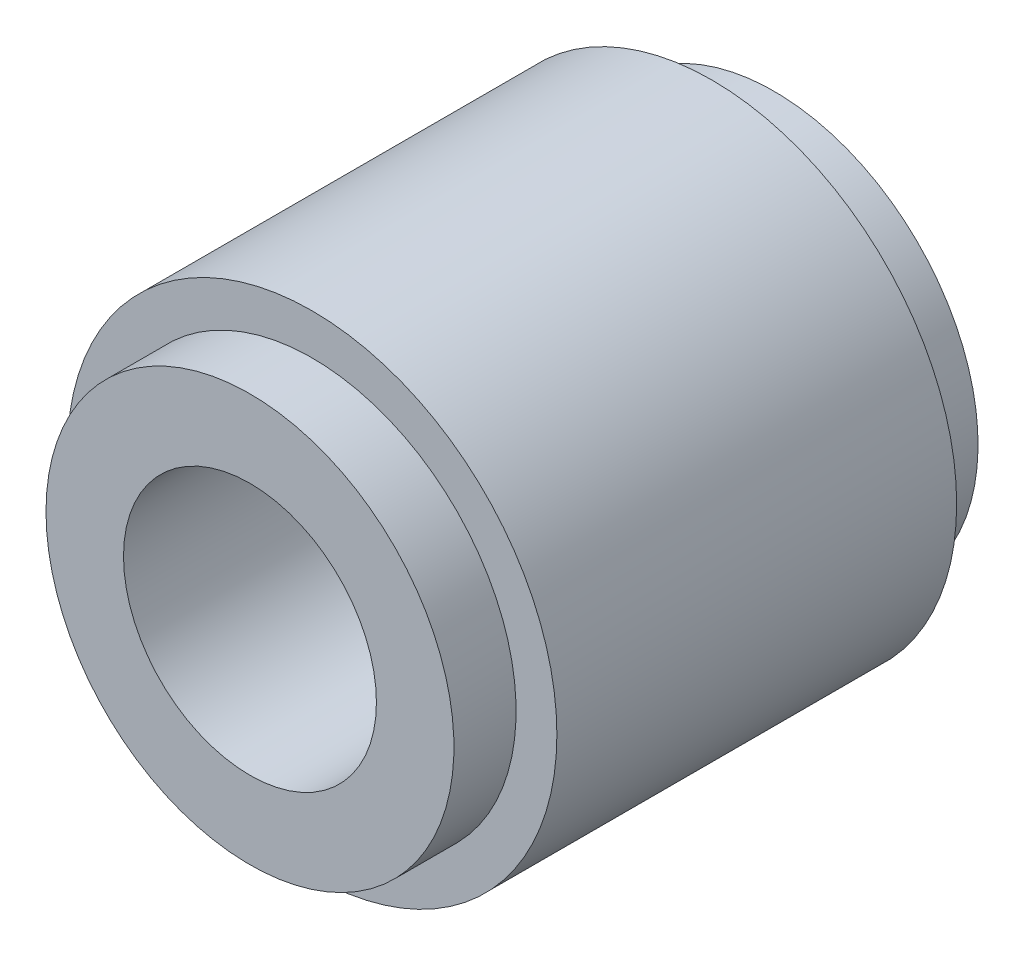
ISO-10303-21;
HEADER;
FILE_DESCRIPTION(('STEP AP214'),'2;1');
FILE_NAME('part.step','',(''),(''),'','','');
FILE_SCHEMA(('AUTOMOTIVE_DESIGN { 1 0 10303 214 1 1 1 1 }'));
ENDSEC;
DATA;
#1=APPLICATION_CONTEXT('core data for automotive mechanical design processes');
#2=APPLICATION_PROTOCOL_DEFINITION('international standard','automotive_design',2000,#1);
#3=PRODUCT_CONTEXT('',#1,'mechanical');
#4=PRODUCT('Part','Part','',(#3));
#5=PRODUCT_RELATED_PRODUCT_CATEGORY('part','',(#4));
#6=PRODUCT_DEFINITION_FORMATION('','',#4);
#7=PRODUCT_DEFINITION_CONTEXT('part definition',#1,'design');
#8=PRODUCT_DEFINITION('design','',#6,#7);
#9=PRODUCT_DEFINITION_SHAPE('','',#8);
#10=(LENGTH_UNIT() NAMED_UNIT(*) SI_UNIT(.MILLI.,.METRE.));
#11=(NAMED_UNIT(*) PLANE_ANGLE_UNIT() SI_UNIT($,.RADIAN.));
#12=(NAMED_UNIT(*) SI_UNIT($,.STERADIAN.) SOLID_ANGLE_UNIT());
#13=UNCERTAINTY_MEASURE_WITH_UNIT(LENGTH_MEASURE(1.E-05),#10,'distance_accuracy_value','');
#14=(GEOMETRIC_REPRESENTATION_CONTEXT(3) GLOBAL_UNCERTAINTY_ASSIGNED_CONTEXT((#13)) GLOBAL_UNIT_ASSIGNED_CONTEXT((#10,
#11,#12)) REPRESENTATION_CONTEXT('',''));
#15=CARTESIAN_POINT('',(0.,0.,0.));
#16=DIRECTION('',(0.,0.,1.));
#17=DIRECTION('',(1.,0.,0.));
#18=AXIS2_PLACEMENT_3D('',#15,#16,#17);
#19=CARTESIAN_POINT('',(0.,0.,2.45));
#20=DIRECTION('',(0.,0.,-1.));
#21=DIRECTION('',(-1.,0.,0.));
#22=AXIS2_PLACEMENT_3D('',#19,#20,#21);
#23=CYLINDRICAL_SURFACE('',#22,1.5);
#24=CARTESIAN_POINT('',(0.,0.,0.));
#25=DIRECTION('',(0.,0.,-1.));
#26=DIRECTION('',(-1.,0.,0.));
#27=AXIS2_PLACEMENT_3D('',#24,#25,#26);
#28=CIRCLE('',#27,1.5);
#29=CARTESIAN_POINT('',(-1.5,0.,0.));
#30=VERTEX_POINT('',#29);
#31=EDGE_CURVE('E19',#30,#30,#28,.F.);
#32=ORIENTED_EDGE('',*,*,#31,.T.);
#33=EDGE_LOOP('',(#32));
#34=FACE_BOUND('',#33,.T.);
#35=CARTESIAN_POINT('',(0.,0.,2.45));
#36=DIRECTION('',(0.,0.,-1.));
#37=DIRECTION('',(-1.,0.,0.));
#38=AXIS2_PLACEMENT_3D('',#35,#36,#37);
#39=CIRCLE('',#38,1.5);
#40=CARTESIAN_POINT('',(-1.5,0.,2.45));
#41=VERTEX_POINT('',#40);
#42=EDGE_CURVE('E41',#41,#41,#39,.F.);
#43=ORIENTED_EDGE('',*,*,#42,.F.);
#44=EDGE_LOOP('',(#43));
#45=FACE_BOUND('',#44,.T.);
#46=ADVANCED_FACE('F15',(#34,#45),#23,.T.);
#47=CARTESIAN_POINT('',(-1.518,-1.518,0.));
#48=DIRECTION('',(0.,0.,1.));
#49=DIRECTION('',(1.,0.,0.));
#50=AXIS2_PLACEMENT_3D('',#47,#48,#49);
#51=PLANE('',#50);
#52=CARTESIAN_POINT('',(0.,0.,0.));
#53=DIRECTION('',(0.,0.,1.));
#54=DIRECTION('',(0.,-1.,0.));
#55=AXIS2_PLACEMENT_3D('',#52,#53,#54);
#56=CIRCLE('',#55,1.25);
#57=CARTESIAN_POINT('',(0.,-1.25,0.));
#58=VERTEX_POINT('',#57);
#59=EDGE_CURVE('E39',#58,#58,#56,.T.);
#60=ORIENTED_EDGE('',*,*,#59,.T.);
#61=EDGE_LOOP('',(#60));
#62=FACE_BOUND('',#61,.T.);
#63=ORIENTED_EDGE('',*,*,#31,.F.);
#64=EDGE_LOOP('',(#63));
#65=FACE_BOUND('',#64,.T.);
#66=ADVANCED_FACE('F50',(#62,#65),#51,.F.);
#67=CARTESIAN_POINT('',(-1.518,-1.518,2.45));
#68=DIRECTION('',(0.,0.,1.));
#69=DIRECTION('',(1.,0.,0.));
#70=AXIS2_PLACEMENT_3D('',#67,#68,#69);
#71=PLANE('',#70);
#72=CARTESIAN_POINT('',(0.,0.,2.45));
#73=DIRECTION('',(0.,0.,-1.));
#74=DIRECTION('',(-1.,0.,0.));
#75=AXIS2_PLACEMENT_3D('',#72,#73,#74);
#76=CIRCLE('',#75,1.25);
#77=CARTESIAN_POINT('',(-1.25,0.,2.45));
#78=VERTEX_POINT('',#77);
#79=EDGE_CURVE('E36',#78,#78,#76,.T.);
#80=ORIENTED_EDGE('',*,*,#79,.T.);
#81=EDGE_LOOP('',(#80));
#82=FACE_BOUND('',#81,.T.);
#83=ORIENTED_EDGE('',*,*,#42,.T.);
#84=EDGE_LOOP('',(#83));
#85=FACE_BOUND('',#84,.T.);
#86=ADVANCED_FACE('F52',(#82,#85),#71,.T.);
#87=CARTESIAN_POINT('',(0.,0.,-0.381));
#88=DIRECTION('',(0.,0.,1.));
#89=DIRECTION('',(0.,-1.,0.));
#90=AXIS2_PLACEMENT_3D('',#87,#88,#89);
#91=CYLINDRICAL_SURFACE('',#90,1.25);
#92=ORIENTED_EDGE('',*,*,#59,.F.);
#93=EDGE_LOOP('',(#92));
#94=FACE_BOUND('',#93,.T.);
#95=CARTESIAN_POINT('',(0.,0.,-0.381));
#96=DIRECTION('',(0.,0.,1.));
#97=DIRECTION('',(0.,-1.,0.));
#98=AXIS2_PLACEMENT_3D('',#95,#96,#97);
#99=CIRCLE('',#98,1.25);
#100=CARTESIAN_POINT('',(0.,-1.25,-0.381));
#101=VERTEX_POINT('',#100);
#102=EDGE_CURVE('E33',#101,#101,#99,.F.);
#103=ORIENTED_EDGE('',*,*,#102,.F.);
#104=EDGE_LOOP('',(#103));
#105=FACE_BOUND('',#104,.T.);
#106=ADVANCED_FACE('F60',(#94,#105),#91,.T.);
#107=CARTESIAN_POINT('',(0.,0.,2.831));
#108=DIRECTION('',(0.,0.,-1.));
#109=DIRECTION('',(-1.,0.,0.));
#110=AXIS2_PLACEMENT_3D('',#107,#108,#109);
#111=CYLINDRICAL_SURFACE('',#110,1.25);
#112=ORIENTED_EDGE('',*,*,#79,.F.);
#113=EDGE_LOOP('',(#112));
#114=FACE_BOUND('',#113,.T.);
#115=CARTESIAN_POINT('',(0.,0.,2.831));
#116=DIRECTION('',(0.,0.,-1.));
#117=DIRECTION('',(-1.,0.,0.));
#118=AXIS2_PLACEMENT_3D('',#115,#116,#117);
#119=CIRCLE('',#118,1.25);
#120=CARTESIAN_POINT('',(-1.25,0.,2.831));
#121=VERTEX_POINT('',#120);
#122=EDGE_CURVE('E28',#121,#121,#119,.F.);
#123=ORIENTED_EDGE('',*,*,#122,.F.);
#124=EDGE_LOOP('',(#123));
#125=FACE_BOUND('',#124,.T.);
#126=ADVANCED_FACE('F74',(#114,#125),#111,.T.);
#127=CARTESIAN_POINT('',(1.265,-1.265,-0.381));
#128=DIRECTION('',(0.,0.,-1.));
#129=DIRECTION('',(-1.,0.,0.));
#130=AXIS2_PLACEMENT_3D('',#127,#128,#129);
#131=PLANE('',#130);
#132=CARTESIAN_POINT('',(0.,0.,-0.381));
#133=DIRECTION('',(0.,0.,1.));
#134=DIRECTION('',(0.,-1.,0.));
#135=AXIS2_PLACEMENT_3D('',#132,#133,#134);
#136=CIRCLE('',#135,0.775);
#137=CARTESIAN_POINT('',(0.,-0.775,-0.381));
#138=VERTEX_POINT('',#137);
#139=EDGE_CURVE('E23',#138,#138,#136,.F.);
#140=ORIENTED_EDGE('',*,*,#139,.F.);
#141=EDGE_LOOP('',(#140));
#142=FACE_BOUND('',#141,.T.);
#143=ORIENTED_EDGE('',*,*,#102,.T.);
#144=EDGE_LOOP('',(#143));
#145=FACE_BOUND('',#144,.T.);
#146=ADVANCED_FACE('F70',(#142,#145),#131,.T.);
#147=CARTESIAN_POINT('',(-1.265,-1.265,2.831));
#148=DIRECTION('',(0.,0.,1.));
#149=DIRECTION('',(1.,0.,0.));
#150=AXIS2_PLACEMENT_3D('',#147,#148,#149);
#151=PLANE('',#150);
#152=CARTESIAN_POINT('',(0.,0.,2.831));
#153=DIRECTION('',(0.,0.,1.));
#154=DIRECTION('',(0.,-1.,0.));
#155=AXIS2_PLACEMENT_3D('',#152,#153,#154);
#156=CIRCLE('',#155,0.775);
#157=CARTESIAN_POINT('',(0.,-0.775,2.831));
#158=VERTEX_POINT('',#157);
#159=EDGE_CURVE('E10',#158,#158,#156,.T.);
#160=ORIENTED_EDGE('',*,*,#159,.F.);
#161=EDGE_LOOP('',(#160));
#162=FACE_BOUND('',#161,.T.);
#163=ORIENTED_EDGE('',*,*,#122,.T.);
#164=EDGE_LOOP('',(#163));
#165=FACE_BOUND('',#164,.T.);
#166=ADVANCED_FACE('F17',(#162,#165),#151,.T.);
#167=CARTESIAN_POINT('',(0.,0.,-0.381));
#168=DIRECTION('',(0.,0.,1.));
#169=DIRECTION('',(0.,-1.,0.));
#170=AXIS2_PLACEMENT_3D('',#167,#168,#169);
#171=CYLINDRICAL_SURFACE('',#170,0.775);
#172=ORIENTED_EDGE('',*,*,#159,.T.);
#173=EDGE_LOOP('',(#172));
#174=FACE_BOUND('',#173,.T.);
#175=ORIENTED_EDGE('',*,*,#139,.T.);
#176=EDGE_LOOP('',(#175));
#177=FACE_BOUND('',#176,.T.);
#178=ADVANCED_FACE('F64',(#174,#177),#171,.F.);
#179=CLOSED_SHELL('',(#46,#66,#86,#106,#126,#146,#166,#178));
#180=MANIFOLD_SOLID_BREP('B1',#179);
#181=ADVANCED_BREP_SHAPE_REPRESENTATION('',(#18,#180),#14);
#182=SHAPE_DEFINITION_REPRESENTATION(#9,#181);
ENDSEC;
END-ISO-10303-21;
